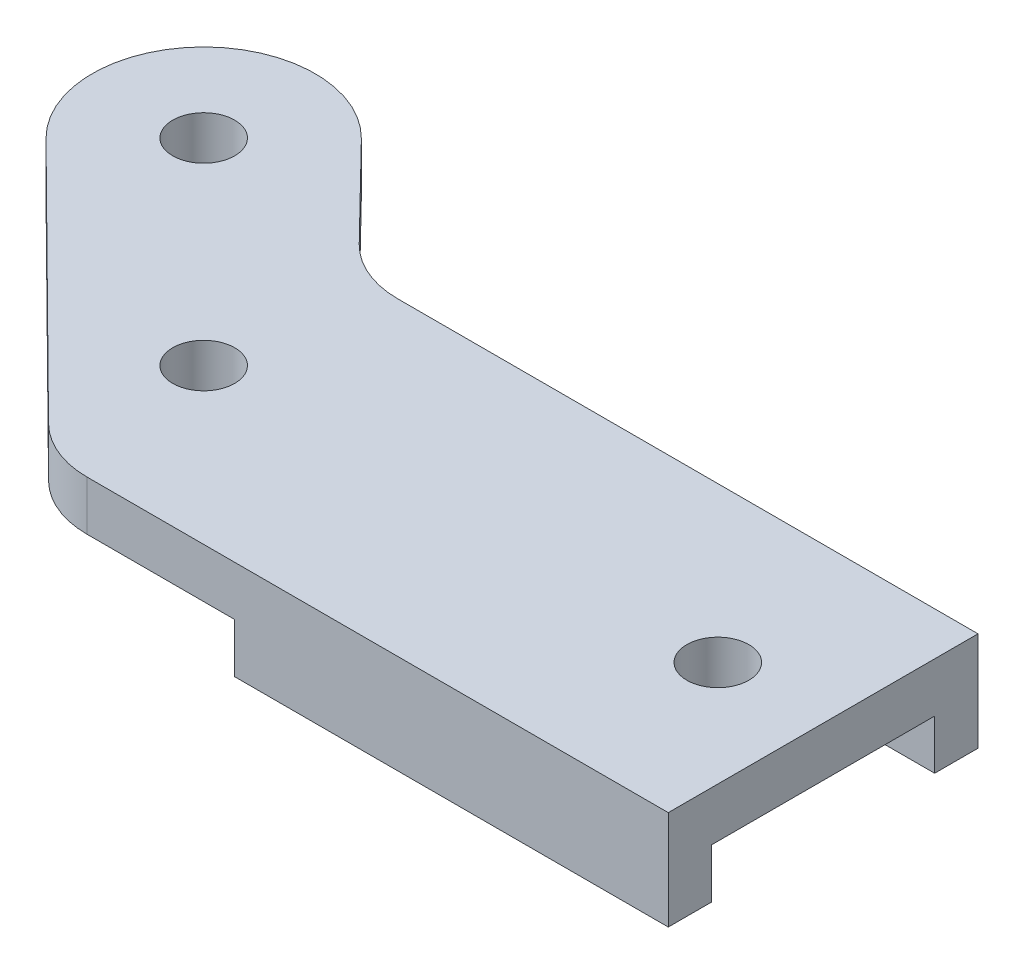
ISO-10303-21;
HEADER;
FILE_DESCRIPTION(('STEP AP214'),'2;1');
FILE_NAME('part.step','',(''),(''),'','','');
FILE_SCHEMA(('AUTOMOTIVE_DESIGN { 1 0 10303 214 1 1 1 1 }'));
ENDSEC;
DATA;
#1=APPLICATION_CONTEXT('core data for automotive mechanical design processes');
#2=APPLICATION_PROTOCOL_DEFINITION('international standard','automotive_design',2000,#1);
#3=PRODUCT_CONTEXT('',#1,'mechanical');
#4=PRODUCT('Part','Part','',(#3));
#5=PRODUCT_RELATED_PRODUCT_CATEGORY('part','',(#4));
#6=PRODUCT_DEFINITION_FORMATION('','',#4);
#7=PRODUCT_DEFINITION_CONTEXT('part definition',#1,'design');
#8=PRODUCT_DEFINITION('design','',#6,#7);
#9=PRODUCT_DEFINITION_SHAPE('','',#8);
#10=(LENGTH_UNIT() NAMED_UNIT(*) SI_UNIT(.MILLI.,.METRE.));
#11=(NAMED_UNIT(*) PLANE_ANGLE_UNIT() SI_UNIT($,.RADIAN.));
#12=(NAMED_UNIT(*) SI_UNIT($,.STERADIAN.) SOLID_ANGLE_UNIT());
#13=UNCERTAINTY_MEASURE_WITH_UNIT(LENGTH_MEASURE(1.E-05),#10,'distance_accuracy_value','');
#14=(GEOMETRIC_REPRESENTATION_CONTEXT(3) GLOBAL_UNCERTAINTY_ASSIGNED_CONTEXT((#13)) GLOBAL_UNIT_ASSIGNED_CONTEXT((#10,
#11,#12)) REPRESENTATION_CONTEXT('',''));
#15=CARTESIAN_POINT('',(0.,0.,0.));
#16=DIRECTION('',(0.,0.,1.));
#17=DIRECTION('',(1.,0.,0.));
#18=AXIS2_PLACEMENT_3D('',#15,#16,#17);
#19=CARTESIAN_POINT('',(-31.8198051533948,0.,-31.8198051533945));
#20=DIRECTION('',(0.,1.,0.));
#21=DIRECTION('',(0.,0.,1.));
#22=AXIS2_PLACEMENT_3D('',#19,#20,#21);
#23=PLANE('',#22);
#24=CARTESIAN_POINT('',(83.,0.,0.));
#25=DIRECTION('',(0.,1.,0.));
#26=DIRECTION('',(0.,0.,1.));
#27=AXIS2_PLACEMENT_3D('',#24,#25,#26);
#28=CIRCLE('',#27,5.);
#29=CARTESIAN_POINT('',(83.,0.,5.));
#30=VERTEX_POINT('',#29);
#31=EDGE_CURVE('E201',#30,#30,#28,.T.);
#32=ORIENTED_EDGE('',*,*,#31,.T.);
#33=EDGE_LOOP('',(#32));
#34=FACE_BOUND('',#33,.T.);
#35=DIRECTION('',(1.,0.,0.));
#36=VECTOR('',#35,1.);
#37=CARTESIAN_POINT('',(50.,0.,18.));
#38=LINE('',#37,#36);
#39=CARTESIAN_POINT('',(50.,0.,18.));
#40=VERTEX_POINT('',#39);
#41=CARTESIAN_POINT('',(100.,0.,18.));
#42=VERTEX_POINT('',#41);
#43=EDGE_CURVE('E161',#40,#42,#38,.T.);
#44=ORIENTED_EDGE('',*,*,#43,.F.);
#45=DIRECTION('',(0.,0.,1.));
#46=VECTOR('',#45,1.);
#47=CARTESIAN_POINT('',(50.,0.,-18.));
#48=LINE('',#47,#46);
#49=CARTESIAN_POINT('',(50.,0.,-18.));
#50=VERTEX_POINT('',#49);
#51=EDGE_CURVE('E164',#50,#40,#48,.T.);
#52=ORIENTED_EDGE('',*,*,#51,.F.);
#53=DIRECTION('',(-1.,0.,0.));
#54=VECTOR('',#53,1.);
#55=CARTESIAN_POINT('',(100.,0.,-18.));
#56=LINE('',#55,#54);
#57=CARTESIAN_POINT('',(100.,0.,-18.));
#58=VERTEX_POINT('',#57);
#59=EDGE_CURVE('E182',#58,#50,#56,.T.);
#60=ORIENTED_EDGE('',*,*,#59,.F.);
#61=DIRECTION('',(0.,0.,-1.));
#62=VECTOR('',#61,1.);
#63=CARTESIAN_POINT('',(100.,0.,-25.));
#64=LINE('',#63,#62);
#65=EDGE_CURVE('E238',#42,#58,#64,.T.);
#66=ORIENTED_EDGE('',*,*,#65,.F.);
#67=EDGE_LOOP('',(#44,#52,#60,#66));
#68=FACE_BOUND('',#67,.T.);
#69=ADVANCED_FACE('F33',(#34,#68),#23,.F.);
#70=CARTESIAN_POINT('',(0.,0.,0.));
#71=DIRECTION('',(0.,1.,0.));
#72=DIRECTION('',(0.,0.,1.));
#73=AXIS2_PLACEMENT_3D('',#70,#71,#72);
#74=CIRCLE('',#73,5.);
#75=CARTESIAN_POINT('',(0.,0.,5.));
#76=VERTEX_POINT('',#75);
#77=EDGE_CURVE('E205',#76,#76,#74,.T.);
#78=ORIENTED_EDGE('',*,*,#77,.T.);
#79=EDGE_LOOP('',(#78));
#80=FACE_BOUND('',#79,.T.);
#81=CARTESIAN_POINT('',(-31.8198051533948,0.,-31.8198051533945));
#82=DIRECTION('',(0.,1.,0.));
#83=DIRECTION('',(0.,0.,1.));
#84=AXIS2_PLACEMENT_3D('',#81,#82,#83);
#85=CIRCLE('',#84,5.);
#86=CARTESIAN_POINT('',(-31.8198051533948,0.,-26.8198051533945));
#87=VERTEX_POINT('',#86);
#88=EDGE_CURVE('E211',#87,#87,#85,.T.);
#89=ORIENTED_EDGE('',*,*,#88,.T.);
#90=EDGE_LOOP('',(#89));
#91=FACE_BOUND('',#90,.T.);
#92=DIRECTION('',(1.,0.,0.));
#93=VECTOR('',#92,1.);
#94=CARTESIAN_POINT('',(0.,0.,25.));
#95=LINE('',#94,#93);
#96=CARTESIAN_POINT('',(6.16803088402929,0.,25.));
#97=VERTEX_POINT('',#96);
#98=CARTESIAN_POINT('',(30.,0.,25.));
#99=VERTEX_POINT('',#98);
#100=EDGE_CURVE('E236',#97,#99,#95,.T.);
#101=ORIENTED_EDGE('',*,*,#100,.F.);
#102=CARTESIAN_POINT('',(6.16803088402929,0.,10.));
#103=DIRECTION('',(0.,1.,0.));
#104=DIRECTION('',(0.,0.,1.));
#105=AXIS2_PLACEMENT_3D('',#102,#103,#104);
#106=CIRCLE('',#105,15.);
#107=CARTESIAN_POINT('',(-4.38384452112235,0.,20.6610471077731));
#108=VERTEX_POINT('',#107);
#109=EDGE_CURVE('E254',#97,#108,#106,.F.);
#110=ORIENTED_EDGE('',*,*,#109,.T.);
#111=DIRECTION('',(0.710736473851536,0.,0.703458360343442));
#112=VECTOR('',#111,1.);
#113=CARTESIAN_POINT('',(0.,0.,25.));
#114=LINE('',#113,#112);
#115=CARTESIAN_POINT('',(-44.4820556395768,0.,-19.0265486240668));
#116=VERTEX_POINT('',#115);
#117=EDGE_CURVE('E217',#116,#108,#114,.T.);
#118=ORIENTED_EDGE('',*,*,#117,.F.);
#119=CARTESIAN_POINT('',(-31.8198051533948,0.,-31.8198051533945));
#120=DIRECTION('',(0.,1.,0.));
#121=DIRECTION('',(0.,0.,1.));
#122=AXIS2_PLACEMENT_3D('',#119,#120,#121);
#123=CIRCLE('',#122,18.);
#124=CARTESIAN_POINT('',(-18.9420427064823,0.,-44.3961016814225));
#125=VERTEX_POINT('',#124);
#126=EDGE_CURVE('E224',#125,#116,#123,.T.);
#127=ORIENTED_EDGE('',*,*,#126,.F.);
#128=DIRECTION('',(-0.698683140446,0.,-0.715431247050697));
#129=VECTOR('',#128,1.);
#130=CARTESIAN_POINT('',(0.,0.,-25.));
#131=LINE('',#130,#129);
#132=CARTESIAN_POINT('',(-4.41394635551046,0.,-29.51975289331));
#133=VERTEX_POINT('',#132);
#134=EDGE_CURVE('E243',#133,#125,#131,.T.);
#135=ORIENTED_EDGE('',*,*,#134,.F.);
#136=CARTESIAN_POINT('',(6.31752235025,0.,-40.));
#137=DIRECTION('',(0.,1.,0.));
#138=DIRECTION('',(0.,0.,1.));
#139=AXIS2_PLACEMENT_3D('',#136,#137,#138);
#140=CIRCLE('',#139,15.);
#141=CARTESIAN_POINT('',(6.31752235025,0.,-25.));
#142=VERTEX_POINT('',#141);
#143=EDGE_CURVE('E41',#133,#142,#140,.T.);
#144=ORIENTED_EDGE('',*,*,#143,.T.);
#145=DIRECTION('',(-1.,0.,0.));
#146=VECTOR('',#145,1.);
#147=CARTESIAN_POINT('',(0.,0.,-25.));
#148=LINE('',#147,#146);
#149=CARTESIAN_POINT('',(30.,0.,-25.));
#150=VERTEX_POINT('',#149);
#151=EDGE_CURVE('E241',#150,#142,#148,.T.);
#152=ORIENTED_EDGE('',*,*,#151,.F.);
#153=DIRECTION('',(0.,0.,-1.));
#154=VECTOR('',#153,1.);
#155=CARTESIAN_POINT('',(30.,0.,25.));
#156=LINE('',#155,#154);
#157=EDGE_CURVE('E179',#99,#150,#156,.T.);
#158=ORIENTED_EDGE('',*,*,#157,.F.);
#159=EDGE_LOOP('',(#101,#110,#118,#127,#135,#144,#152,#158));
#160=FACE_BOUND('',#159,.T.);
#161=ADVANCED_FACE('F266',(#80,#91,#160),#23,.F.);
#162=CARTESIAN_POINT('',(-31.8198051533948,8.,-31.8198051533945));
#163=DIRECTION('',(0.,1.,0.));
#164=DIRECTION('',(0.,0.,1.));
#165=AXIS2_PLACEMENT_3D('',#162,#163,#164);
#166=PLANE('',#165);
#167=CARTESIAN_POINT('',(0.,8.,0.));
#168=DIRECTION('',(0.,1.,0.));
#169=DIRECTION('',(0.,0.,1.));
#170=AXIS2_PLACEMENT_3D('',#167,#168,#169);
#171=CIRCLE('',#170,5.);
#172=CARTESIAN_POINT('',(0.,8.,5.));
#173=VERTEX_POINT('',#172);
#174=EDGE_CURVE('E208',#173,#173,#171,.T.);
#175=ORIENTED_EDGE('',*,*,#174,.F.);
#176=EDGE_LOOP('',(#175));
#177=FACE_BOUND('',#176,.T.);
#178=DIRECTION('',(0.710736473851536,0.,0.703458360343442));
#179=VECTOR('',#178,1.);
#180=CARTESIAN_POINT('',(0.,8.,25.));
#181=LINE('',#180,#179);
#182=CARTESIAN_POINT('',(-44.4820556395768,8.,-19.0265486240668));
#183=VERTEX_POINT('',#182);
#184=CARTESIAN_POINT('',(-4.38384452112235,8.,20.6610471077731));
#185=VERTEX_POINT('',#184);
#186=EDGE_CURVE('E220',#183,#185,#181,.T.);
#187=ORIENTED_EDGE('',*,*,#186,.T.);
#188=CARTESIAN_POINT('',(6.16803088402929,8.,10.));
#189=DIRECTION('',(0.,1.,0.));
#190=DIRECTION('',(0.,0.,1.));
#191=AXIS2_PLACEMENT_3D('',#188,#189,#190);
#192=CIRCLE('',#191,15.);
#193=CARTESIAN_POINT('',(6.16803088402929,8.,25.));
#194=VERTEX_POINT('',#193);
#195=EDGE_CURVE('E258',#185,#194,#192,.T.);
#196=ORIENTED_EDGE('',*,*,#195,.T.);
#197=DIRECTION('',(1.,0.,0.));
#198=VECTOR('',#197,1.);
#199=CARTESIAN_POINT('',(0.,8.,25.));
#200=LINE('',#199,#198);
#201=CARTESIAN_POINT('',(100.,8.,25.));
#202=VERTEX_POINT('',#201);
#203=EDGE_CURVE('E223',#194,#202,#200,.T.);
#204=ORIENTED_EDGE('',*,*,#203,.T.);
#205=DIRECTION('',(0.,0.,-1.));
#206=VECTOR('',#205,1.);
#207=CARTESIAN_POINT('',(100.,8.,-25.));
#208=LINE('',#207,#206);
#209=CARTESIAN_POINT('',(100.,8.,-25.));
#210=VERTEX_POINT('',#209);
#211=EDGE_CURVE('E142',#202,#210,#208,.T.);
#212=ORIENTED_EDGE('',*,*,#211,.T.);
#213=DIRECTION('',(-1.,0.,0.));
#214=VECTOR('',#213,1.);
#215=CARTESIAN_POINT('',(0.,8.,-25.));
#216=LINE('',#215,#214);
#217=CARTESIAN_POINT('',(6.31752235025,8.,-25.));
#218=VERTEX_POINT('',#217);
#219=EDGE_CURVE('E227',#210,#218,#216,.T.);
#220=ORIENTED_EDGE('',*,*,#219,.T.);
#221=CARTESIAN_POINT('',(6.31752235025,8.,-40.));
#222=DIRECTION('',(0.,1.,0.));
#223=DIRECTION('',(0.,0.,1.));
#224=AXIS2_PLACEMENT_3D('',#221,#222,#223);
#225=CIRCLE('',#224,15.);
#226=CARTESIAN_POINT('',(-4.41394635551046,8.,-29.51975289331));
#227=VERTEX_POINT('',#226);
#228=EDGE_CURVE('E11',#218,#227,#225,.F.);
#229=ORIENTED_EDGE('',*,*,#228,.T.);
#230=DIRECTION('',(-0.698683140446,0.,-0.715431247050697));
#231=VECTOR('',#230,1.);
#232=CARTESIAN_POINT('',(0.,8.,-25.));
#233=LINE('',#232,#231);
#234=CARTESIAN_POINT('',(-18.9420427064823,8.,-44.3961016814225));
#235=VERTEX_POINT('',#234);
#236=EDGE_CURVE('E229',#227,#235,#233,.T.);
#237=ORIENTED_EDGE('',*,*,#236,.T.);
#238=CARTESIAN_POINT('',(-31.8198051533948,8.,-31.8198051533945));
#239=DIRECTION('',(0.,1.,0.));
#240=DIRECTION('',(0.,0.,1.));
#241=AXIS2_PLACEMENT_3D('',#238,#239,#240);
#242=CIRCLE('',#241,18.);
#243=EDGE_CURVE('E231',#235,#183,#242,.T.);
#244=ORIENTED_EDGE('',*,*,#243,.T.);
#245=EDGE_LOOP('',(#187,#196,#204,#212,#220,#229,#237,#244));
#246=FACE_BOUND('',#245,.T.);
#247=CARTESIAN_POINT('',(-31.8198051533948,8.,-31.8198051533945));
#248=DIRECTION('',(0.,1.,0.));
#249=DIRECTION('',(0.,0.,1.));
#250=AXIS2_PLACEMENT_3D('',#247,#248,#249);
#251=CIRCLE('',#250,5.);
#252=CARTESIAN_POINT('',(-31.8198051533948,8.,-26.8198051533945));
#253=VERTEX_POINT('',#252);
#254=EDGE_CURVE('E214',#253,#253,#251,.T.);
#255=ORIENTED_EDGE('',*,*,#254,.F.);
#256=EDGE_LOOP('',(#255));
#257=FACE_BOUND('',#256,.T.);
#258=CARTESIAN_POINT('',(83.,8.,0.));
#259=DIRECTION('',(0.,1.,0.));
#260=DIRECTION('',(0.,0.,1.));
#261=AXIS2_PLACEMENT_3D('',#258,#259,#260);
#262=CIRCLE('',#261,5.);
#263=CARTESIAN_POINT('',(83.,8.,5.));
#264=VERTEX_POINT('',#263);
#265=EDGE_CURVE('E202',#264,#264,#262,.T.);
#266=ORIENTED_EDGE('',*,*,#265,.F.);
#267=EDGE_LOOP('',(#266));
#268=FACE_BOUND('',#267,.T.);
#269=ADVANCED_FACE('F278',(#177,#246,#257,#268),#166,.T.);
#270=CARTESIAN_POINT('',(0.,8.,25.));
#271=DIRECTION('',(0.703458360343442,0.,-0.710736473851536));
#272=DIRECTION('',(-0.710736473851536,0.,-0.703458360343442));
#273=AXIS2_PLACEMENT_3D('',#270,#271,#272);
#274=PLANE('',#273);
#275=ORIENTED_EDGE('',*,*,#117,.T.);
#276=DIRECTION('',(0.,-1.,0.));
#277=VECTOR('',#276,1.);
#278=CARTESIAN_POINT('',(-4.38384452112235,8.,20.6610471077731));
#279=LINE('',#278,#277);
#280=EDGE_CURVE('E256',#108,#185,#279,.F.);
#281=ORIENTED_EDGE('',*,*,#280,.T.);
#282=ORIENTED_EDGE('',*,*,#186,.F.);
#283=DIRECTION('',(0.,-1.,0.));
#284=VECTOR('',#283,1.);
#285=CARTESIAN_POINT('',(-44.4820556395768,8.,-19.0265486240668));
#286=LINE('',#285,#284);
#287=EDGE_CURVE('E233',#183,#116,#286,.T.);
#288=ORIENTED_EDGE('',*,*,#287,.T.);
#289=EDGE_LOOP('',(#275,#281,#282,#288));
#290=FACE_BOUND('',#289,.T.);
#291=ADVANCED_FACE('F287',(#290),#274,.F.);
#292=CARTESIAN_POINT('',(0.,8.,25.));
#293=DIRECTION('',(0.,0.,-1.));
#294=DIRECTION('',(-1.,0.,0.));
#295=AXIS2_PLACEMENT_3D('',#292,#293,#294);
#296=PLANE('',#295);
#297=ORIENTED_EDGE('',*,*,#203,.F.);
#298=DIRECTION('',(0.,-1.,0.));
#299=VECTOR('',#298,1.);
#300=CARTESIAN_POINT('',(6.16803088402929,8.,25.));
#301=LINE('',#300,#299);
#302=EDGE_CURVE('E145',#194,#97,#301,.T.);
#303=ORIENTED_EDGE('',*,*,#302,.T.);
#304=ORIENTED_EDGE('',*,*,#100,.T.);
#305=DIRECTION('',(0.,1.,0.));
#306=VECTOR('',#305,1.);
#307=CARTESIAN_POINT('',(30.,-8.,25.));
#308=LINE('',#307,#306);
#309=CARTESIAN_POINT('',(30.,-8.,25.));
#310=VERTEX_POINT('',#309);
#311=EDGE_CURVE('E152',#310,#99,#308,.T.);
#312=ORIENTED_EDGE('',*,*,#311,.F.);
#313=DIRECTION('',(-1.,0.,0.));
#314=VECTOR('',#313,1.);
#315=CARTESIAN_POINT('',(100.,-8.,25.));
#316=LINE('',#315,#314);
#317=CARTESIAN_POINT('',(100.,-8.,25.));
#318=VERTEX_POINT('',#317);
#319=EDGE_CURVE('E149',#318,#310,#316,.T.);
#320=ORIENTED_EDGE('',*,*,#319,.F.);
#321=DIRECTION('',(0.,-1.,0.));
#322=VECTOR('',#321,1.);
#323=CARTESIAN_POINT('',(100.,8.,25.));
#324=LINE('',#323,#322);
#325=EDGE_CURVE('E135',#202,#318,#324,.T.);
#326=ORIENTED_EDGE('',*,*,#325,.F.);
#327=EDGE_LOOP('',(#297,#303,#304,#312,#320,#326));
#328=FACE_BOUND('',#327,.T.);
#329=ADVANCED_FACE('F150',(#328),#296,.F.);
#330=CARTESIAN_POINT('',(100.,8.,-25.));
#331=DIRECTION('',(-1.,0.,0.));
#332=DIRECTION('',(0.,0.,1.));
#333=AXIS2_PLACEMENT_3D('',#330,#331,#332);
#334=PLANE('',#333);
#335=ORIENTED_EDGE('',*,*,#325,.T.);
#336=DIRECTION('',(0.,0.,1.));
#337=VECTOR('',#336,1.);
#338=CARTESIAN_POINT('',(100.,-8.,18.));
#339=LINE('',#338,#337);
#340=CARTESIAN_POINT('',(100.,-8.,18.));
#341=VERTEX_POINT('',#340);
#342=EDGE_CURVE('E140',#341,#318,#339,.T.);
#343=ORIENTED_EDGE('',*,*,#342,.F.);
#344=DIRECTION('',(0.,1.,0.));
#345=VECTOR('',#344,1.);
#346=CARTESIAN_POINT('',(100.,-8.,18.));
#347=LINE('',#346,#345);
#348=EDGE_CURVE('E178',#341,#42,#347,.T.);
#349=ORIENTED_EDGE('',*,*,#348,.T.);
#350=ORIENTED_EDGE('',*,*,#65,.T.);
#351=DIRECTION('',(0.,1.,0.));
#352=VECTOR('',#351,1.);
#353=CARTESIAN_POINT('',(100.,-8.,-18.));
#354=LINE('',#353,#352);
#355=CARTESIAN_POINT('',(100.,-8.,-18.));
#356=VERTEX_POINT('',#355);
#357=EDGE_CURVE('E194',#356,#58,#354,.T.);
#358=ORIENTED_EDGE('',*,*,#357,.F.);
#359=DIRECTION('',(0.,0.,1.));
#360=VECTOR('',#359,1.);
#361=CARTESIAN_POINT('',(100.,-8.,-25.));
#362=LINE('',#361,#360);
#363=CARTESIAN_POINT('',(100.,-8.,-25.));
#364=VERTEX_POINT('',#363);
#365=EDGE_CURVE('E171',#364,#356,#362,.T.);
#366=ORIENTED_EDGE('',*,*,#365,.F.);
#367=DIRECTION('',(0.,-1.,0.));
#368=VECTOR('',#367,1.);
#369=CARTESIAN_POINT('',(100.,8.,-25.));
#370=LINE('',#369,#368);
#371=EDGE_CURVE('E146',#210,#364,#370,.T.);
#372=ORIENTED_EDGE('',*,*,#371,.F.);
#373=ORIENTED_EDGE('',*,*,#211,.F.);
#374=EDGE_LOOP('',(#335,#343,#349,#350,#358,#366,#372,#373));
#375=FACE_BOUND('',#374,.T.);
#376=ADVANCED_FACE('F137',(#375),#334,.F.);
#377=CARTESIAN_POINT('',(0.,8.,-25.));
#378=DIRECTION('',(0.,0.,1.));
#379=DIRECTION('',(1.,0.,0.));
#380=AXIS2_PLACEMENT_3D('',#377,#378,#379);
#381=PLANE('',#380);
#382=ORIENTED_EDGE('',*,*,#151,.T.);
#383=DIRECTION('',(0.,-1.,0.));
#384=VECTOR('',#383,1.);
#385=CARTESIAN_POINT('',(6.31752235025,8.,-25.));
#386=LINE('',#385,#384);
#387=EDGE_CURVE('E54',#142,#218,#386,.F.);
#388=ORIENTED_EDGE('',*,*,#387,.T.);
#389=ORIENTED_EDGE('',*,*,#219,.F.);
#390=ORIENTED_EDGE('',*,*,#371,.T.);
#391=DIRECTION('',(1.,0.,0.));
#392=VECTOR('',#391,1.);
#393=CARTESIAN_POINT('',(30.,-8.,-25.));
#394=LINE('',#393,#392);
#395=CARTESIAN_POINT('',(30.,-8.,-25.));
#396=VERTEX_POINT('',#395);
#397=EDGE_CURVE('E168',#396,#364,#394,.T.);
#398=ORIENTED_EDGE('',*,*,#397,.F.);
#399=DIRECTION('',(0.,1.,0.));
#400=VECTOR('',#399,1.);
#401=CARTESIAN_POINT('',(30.,-8.,-25.));
#402=LINE('',#401,#400);
#403=EDGE_CURVE('E197',#396,#150,#402,.T.);
#404=ORIENTED_EDGE('',*,*,#403,.T.);
#405=EDGE_LOOP('',(#382,#388,#389,#390,#398,#404));
#406=FACE_BOUND('',#405,.T.);
#407=ADVANCED_FACE('F271',(#406),#381,.F.);
#408=CARTESIAN_POINT('',(0.,8.,-25.));
#409=DIRECTION('',(-0.715431247050697,0.,0.698683140446));
#410=DIRECTION('',(0.698683140446,0.,0.715431247050697));
#411=AXIS2_PLACEMENT_3D('',#408,#409,#410);
#412=PLANE('',#411);
#413=ORIENTED_EDGE('',*,*,#236,.F.);
#414=DIRECTION('',(0.,-1.,0.));
#415=VECTOR('',#414,1.);
#416=CARTESIAN_POINT('',(-4.41394635551046,0.,-29.51975289331));
#417=LINE('',#416,#415);
#418=EDGE_CURVE('E260',#227,#133,#417,.T.);
#419=ORIENTED_EDGE('',*,*,#418,.T.);
#420=ORIENTED_EDGE('',*,*,#134,.T.);
#421=DIRECTION('',(0.,-1.,0.));
#422=VECTOR('',#421,1.);
#423=CARTESIAN_POINT('',(-18.9420427064823,8.,-44.3961016814225));
#424=LINE('',#423,#422);
#425=EDGE_CURVE('E248',#235,#125,#424,.T.);
#426=ORIENTED_EDGE('',*,*,#425,.F.);
#427=EDGE_LOOP('',(#413,#419,#420,#426));
#428=FACE_BOUND('',#427,.T.);
#429=ADVANCED_FACE('F275',(#428),#412,.F.);
#430=CARTESIAN_POINT('',(-31.8198051533948,8.,-31.8198051533945));
#431=DIRECTION('',(0.,-1.,0.));
#432=DIRECTION('',(0.,0.,-1.));
#433=AXIS2_PLACEMENT_3D('',#430,#431,#432);
#434=CYLINDRICAL_SURFACE('',#433,18.);
#435=ORIENTED_EDGE('',*,*,#126,.T.);
#436=ORIENTED_EDGE('',*,*,#287,.F.);
#437=ORIENTED_EDGE('',*,*,#243,.F.);
#438=ORIENTED_EDGE('',*,*,#425,.T.);
#439=EDGE_LOOP('',(#435,#436,#437,#438));
#440=FACE_BOUND('',#439,.T.);
#441=ADVANCED_FACE('F284',(#440),#434,.T.);
#442=CARTESIAN_POINT('',(-31.8198051533948,8.,-31.8198051533945));
#443=DIRECTION('',(0.,-1.,0.));
#444=DIRECTION('',(0.,0.,-1.));
#445=AXIS2_PLACEMENT_3D('',#442,#443,#444);
#446=CYLINDRICAL_SURFACE('',#445,5.);
#447=ORIENTED_EDGE('',*,*,#254,.T.);
#448=EDGE_LOOP('',(#447));
#449=FACE_BOUND('',#448,.T.);
#450=ORIENTED_EDGE('',*,*,#88,.F.);
#451=EDGE_LOOP('',(#450));
#452=FACE_BOUND('',#451,.T.);
#453=ADVANCED_FACE('F319',(#449,#452),#446,.F.);
#454=CARTESIAN_POINT('',(0.,8.,0.));
#455=DIRECTION('',(0.,-1.,0.));
#456=DIRECTION('',(0.,0.,-1.));
#457=AXIS2_PLACEMENT_3D('',#454,#455,#456);
#458=CYLINDRICAL_SURFACE('',#457,5.);
#459=ORIENTED_EDGE('',*,*,#174,.T.);
#460=EDGE_LOOP('',(#459));
#461=FACE_BOUND('',#460,.T.);
#462=ORIENTED_EDGE('',*,*,#77,.F.);
#463=EDGE_LOOP('',(#462));
#464=FACE_BOUND('',#463,.T.);
#465=ADVANCED_FACE('F349',(#461,#464),#458,.F.);
#466=CARTESIAN_POINT('',(83.,8.,0.));
#467=DIRECTION('',(0.,-1.,0.));
#468=DIRECTION('',(0.,0.,-1.));
#469=AXIS2_PLACEMENT_3D('',#466,#467,#468);
#470=CYLINDRICAL_SURFACE('',#469,5.);
#471=ORIENTED_EDGE('',*,*,#265,.T.);
#472=EDGE_LOOP('',(#471));
#473=FACE_BOUND('',#472,.T.);
#474=ORIENTED_EDGE('',*,*,#31,.F.);
#475=EDGE_LOOP('',(#474));
#476=FACE_BOUND('',#475,.T.);
#477=ADVANCED_FACE('F346',(#473,#476),#470,.F.);
#478=CARTESIAN_POINT('',(30.,-8.,25.));
#479=DIRECTION('',(1.,0.,0.));
#480=DIRECTION('',(0.,0.,-1.));
#481=AXIS2_PLACEMENT_3D('',#478,#479,#480);
#482=PLANE('',#481);
#483=ORIENTED_EDGE('',*,*,#157,.T.);
#484=ORIENTED_EDGE('',*,*,#403,.F.);
#485=DIRECTION('',(0.,0.,-1.));
#486=VECTOR('',#485,1.);
#487=CARTESIAN_POINT('',(30.,-8.,25.));
#488=LINE('',#487,#486);
#489=EDGE_CURVE('E155',#310,#396,#488,.T.);
#490=ORIENTED_EDGE('',*,*,#489,.F.);
#491=ORIENTED_EDGE('',*,*,#311,.T.);
#492=EDGE_LOOP('',(#483,#484,#490,#491));
#493=FACE_BOUND('',#492,.T.);
#494=ADVANCED_FACE('F293',(#493),#482,.F.);
#495=CARTESIAN_POINT('',(100.,-8.,-18.));
#496=DIRECTION('',(0.,0.,-1.));
#497=DIRECTION('',(-1.,0.,0.));
#498=AXIS2_PLACEMENT_3D('',#495,#496,#497);
#499=PLANE('',#498);
#500=ORIENTED_EDGE('',*,*,#59,.T.);
#501=DIRECTION('',(0.,1.,0.));
#502=VECTOR('',#501,1.);
#503=CARTESIAN_POINT('',(50.,-8.,-18.));
#504=LINE('',#503,#502);
#505=CARTESIAN_POINT('',(50.,-8.,-18.));
#506=VERTEX_POINT('',#505);
#507=EDGE_CURVE('E191',#506,#50,#504,.T.);
#508=ORIENTED_EDGE('',*,*,#507,.F.);
#509=DIRECTION('',(-1.,0.,0.));
#510=VECTOR('',#509,1.);
#511=CARTESIAN_POINT('',(100.,-8.,-18.));
#512=LINE('',#511,#510);
#513=EDGE_CURVE('E173',#356,#506,#512,.T.);
#514=ORIENTED_EDGE('',*,*,#513,.F.);
#515=ORIENTED_EDGE('',*,*,#357,.T.);
#516=EDGE_LOOP('',(#500,#508,#514,#515));
#517=FACE_BOUND('',#516,.T.);
#518=ADVANCED_FACE('F299',(#517),#499,.F.);
#519=CARTESIAN_POINT('',(50.,-8.,-18.));
#520=DIRECTION('',(-1.,0.,0.));
#521=DIRECTION('',(0.,0.,1.));
#522=AXIS2_PLACEMENT_3D('',#519,#520,#521);
#523=PLANE('',#522);
#524=ORIENTED_EDGE('',*,*,#51,.T.);
#525=DIRECTION('',(0.,1.,0.));
#526=VECTOR('',#525,1.);
#527=CARTESIAN_POINT('',(50.,-8.,18.));
#528=LINE('',#527,#526);
#529=CARTESIAN_POINT('',(50.,-8.,18.));
#530=VERTEX_POINT('',#529);
#531=EDGE_CURVE('E188',#530,#40,#528,.T.);
#532=ORIENTED_EDGE('',*,*,#531,.F.);
#533=DIRECTION('',(0.,0.,1.));
#534=VECTOR('',#533,1.);
#535=CARTESIAN_POINT('',(50.,-8.,-18.));
#536=LINE('',#535,#534);
#537=EDGE_CURVE('E175',#506,#530,#536,.T.);
#538=ORIENTED_EDGE('',*,*,#537,.F.);
#539=ORIENTED_EDGE('',*,*,#507,.T.);
#540=EDGE_LOOP('',(#524,#532,#538,#539));
#541=FACE_BOUND('',#540,.T.);
#542=ADVANCED_FACE('F303',(#541),#523,.F.);
#543=CARTESIAN_POINT('',(50.,-8.,18.));
#544=DIRECTION('',(0.,0.,1.));
#545=DIRECTION('',(1.,0.,0.));
#546=AXIS2_PLACEMENT_3D('',#543,#544,#545);
#547=PLANE('',#546);
#548=ORIENTED_EDGE('',*,*,#43,.T.);
#549=ORIENTED_EDGE('',*,*,#348,.F.);
#550=DIRECTION('',(1.,0.,0.));
#551=VECTOR('',#550,1.);
#552=CARTESIAN_POINT('',(50.,-8.,18.));
#553=LINE('',#552,#551);
#554=EDGE_CURVE('E159',#530,#341,#553,.T.);
#555=ORIENTED_EDGE('',*,*,#554,.F.);
#556=ORIENTED_EDGE('',*,*,#531,.T.);
#557=EDGE_LOOP('',(#548,#549,#555,#556));
#558=FACE_BOUND('',#557,.T.);
#559=ADVANCED_FACE('F305',(#558),#547,.F.);
#560=CARTESIAN_POINT('',(0.,-8.,0.));
#561=DIRECTION('',(0.,-1.,0.));
#562=DIRECTION('',(0.,0.,-1.));
#563=AXIS2_PLACEMENT_3D('',#560,#561,#562);
#564=PLANE('',#563);
#565=ORIENTED_EDGE('',*,*,#342,.T.);
#566=ORIENTED_EDGE('',*,*,#319,.T.);
#567=ORIENTED_EDGE('',*,*,#489,.T.);
#568=ORIENTED_EDGE('',*,*,#397,.T.);
#569=ORIENTED_EDGE('',*,*,#365,.T.);
#570=ORIENTED_EDGE('',*,*,#513,.T.);
#571=ORIENTED_EDGE('',*,*,#537,.T.);
#572=ORIENTED_EDGE('',*,*,#554,.T.);
#573=EDGE_LOOP('',(#565,#566,#567,#568,#569,#570,#571,#572));
#574=FACE_BOUND('',#573,.T.);
#575=ADVANCED_FACE('F157',(#574),#564,.T.);
#576=CARTESIAN_POINT('',(6.16803088402929,8.,10.));
#577=DIRECTION('',(0.,-1.,0.));
#578=DIRECTION('',(0.,0.,-1.));
#579=AXIS2_PLACEMENT_3D('',#576,#577,#578);
#580=CYLINDRICAL_SURFACE('',#579,15.);
#581=ORIENTED_EDGE('',*,*,#195,.F.);
#582=ORIENTED_EDGE('',*,*,#280,.F.);
#583=ORIENTED_EDGE('',*,*,#109,.F.);
#584=ORIENTED_EDGE('',*,*,#302,.F.);
#585=EDGE_LOOP('',(#581,#582,#583,#584));
#586=FACE_BOUND('',#585,.T.);
#587=ADVANCED_FACE('F290',(#586),#580,.T.);
#588=CARTESIAN_POINT('',(6.31752235025,8.,-40.));
#589=DIRECTION('',(0.,1.,0.));
#590=DIRECTION('',(0.,0.,1.));
#591=AXIS2_PLACEMENT_3D('',#588,#589,#590);
#592=CYLINDRICAL_SURFACE('',#591,15.);
#593=ORIENTED_EDGE('',*,*,#228,.F.);
#594=ORIENTED_EDGE('',*,*,#387,.F.);
#595=ORIENTED_EDGE('',*,*,#143,.F.);
#596=ORIENTED_EDGE('',*,*,#418,.F.);
#597=EDGE_LOOP('',(#593,#594,#595,#596));
#598=FACE_BOUND('',#597,.T.);
#599=ADVANCED_FACE('F35',(#598),#592,.F.);
#600=CLOSED_SHELL('',(#69,#161,#269,#291,#329,#376,#407,#429,#441,#453,#465,#477,#494,#518,#542,
#559,#575,#587,#599));
#601=MANIFOLD_SOLID_BREP('B2',#600);
#602=ADVANCED_BREP_SHAPE_REPRESENTATION('',(#18,#601),#14);
#603=SHAPE_DEFINITION_REPRESENTATION(#9,#602);
ENDSEC;
END-ISO-10303-21;
